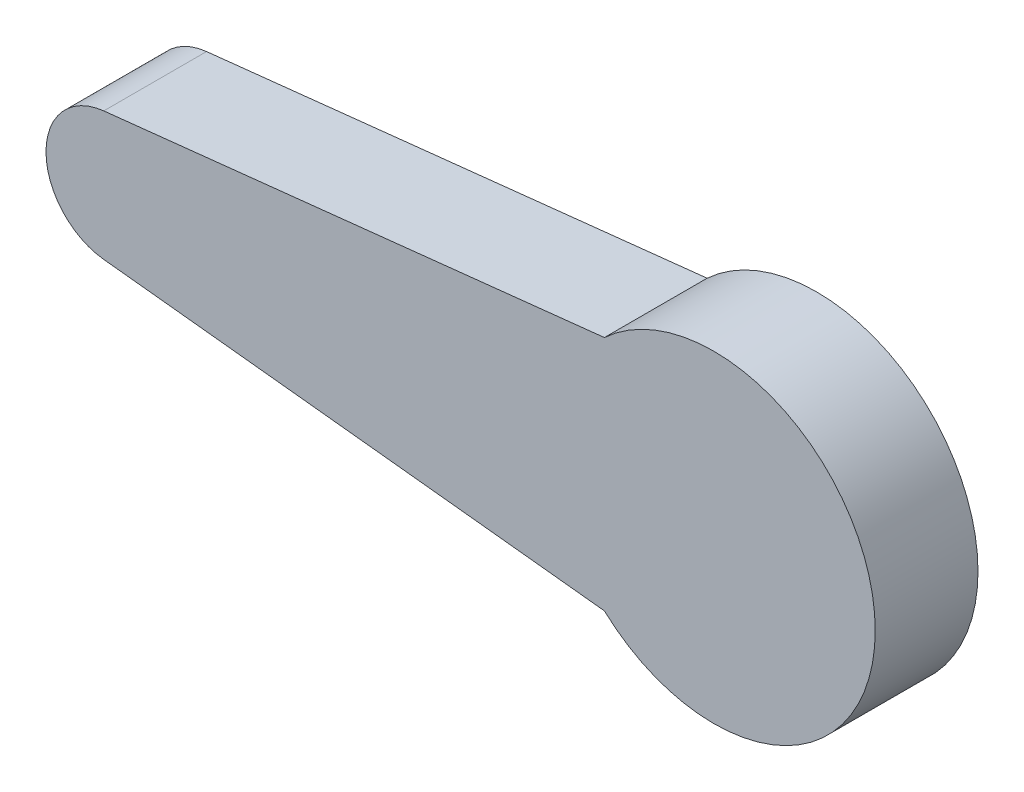
ISO-10303-21;
HEADER;
FILE_DESCRIPTION(('STEP AP214'),'2;1');
FILE_NAME('part.step','',(''),(''),'','','');
FILE_SCHEMA(('AUTOMOTIVE_DESIGN { 1 0 10303 214 1 1 1 1 }'));
ENDSEC;
DATA;
#1=APPLICATION_CONTEXT('core data for automotive mechanical design processes');
#2=APPLICATION_PROTOCOL_DEFINITION('international standard','automotive_design',2000,#1);
#3=PRODUCT_CONTEXT('',#1,'mechanical');
#4=PRODUCT('Part','Part','',(#3));
#5=PRODUCT_RELATED_PRODUCT_CATEGORY('part','',(#4));
#6=PRODUCT_DEFINITION_FORMATION('','',#4);
#7=PRODUCT_DEFINITION_CONTEXT('part definition',#1,'design');
#8=PRODUCT_DEFINITION('design','',#6,#7);
#9=PRODUCT_DEFINITION_SHAPE('','',#8);
#10=(LENGTH_UNIT() NAMED_UNIT(*) SI_UNIT(.MILLI.,.METRE.));
#11=(NAMED_UNIT(*) PLANE_ANGLE_UNIT() SI_UNIT($,.RADIAN.));
#12=(NAMED_UNIT(*) SI_UNIT($,.STERADIAN.) SOLID_ANGLE_UNIT());
#13=UNCERTAINTY_MEASURE_WITH_UNIT(LENGTH_MEASURE(1.E-05),#10,'distance_accuracy_value','');
#14=(GEOMETRIC_REPRESENTATION_CONTEXT(3) GLOBAL_UNCERTAINTY_ASSIGNED_CONTEXT((#13)) GLOBAL_UNIT_ASSIGNED_CONTEXT((#10,
#11,#12)) REPRESENTATION_CONTEXT('',''));
#15=CARTESIAN_POINT('',(0.,0.,0.));
#16=DIRECTION('',(0.,0.,1.));
#17=DIRECTION('',(1.,0.,0.));
#18=AXIS2_PLACEMENT_3D('',#15,#16,#17);
#19=CARTESIAN_POINT('',(-11.2799246231682,0.,0.));
#20=DIRECTION('',(0.,0.,1.));
#21=DIRECTION('',(1.,0.,0.));
#22=AXIS2_PLACEMENT_3D('',#19,#20,#21);
#23=PLANE('',#22);
#24=DIRECTION('',(-0.994225438983225,-0.10731158594771,0.));
#25=VECTOR('',#24,1.);
#26=CARTESIAN_POINT('',(7.93694518506527,4.60750982165337,0.));
#27=LINE('',#26,#25);
#28=CARTESIAN_POINT('',(7.93694518506527,4.60750982165337,0.));
#29=VERTEX_POINT('',#28);
#30=CARTESIAN_POINT('',(-11.5502114628193,2.50416625036577,0.));
#31=VERTEX_POINT('',#30);
#32=EDGE_CURVE('E134',#29,#31,#27,.T.);
#33=ORIENTED_EDGE('',*,*,#32,.F.);
#34=CARTESIAN_POINT('',(12.2013646778512,0.,0.));
#35=DIRECTION('',(0.,0.,-1.));
#36=DIRECTION('',(-1.,0.,0.));
#37=AXIS2_PLACEMENT_3D('',#34,#35,#36);
#38=CIRCLE('',#37,6.2780905032569);
#39=CARTESIAN_POINT('',(7.93694518506527,-4.60750982165337,0.));
#40=VERTEX_POINT('',#39);
#41=EDGE_CURVE('E145',#29,#40,#38,.T.);
#42=ORIENTED_EDGE('',*,*,#41,.T.);
#43=DIRECTION('',(0.994225438983225,-0.10731158594771,0.));
#44=VECTOR('',#43,1.);
#45=CARTESIAN_POINT('',(-11.5502114628193,-2.50416625036577,0.));
#46=LINE('',#45,#44);
#47=CARTESIAN_POINT('',(-11.5502114628193,-2.50416625036577,0.));
#48=VERTEX_POINT('',#47);
#49=EDGE_CURVE('E152',#48,#40,#46,.T.);
#50=ORIENTED_EDGE('',*,*,#49,.F.);
#51=CARTESIAN_POINT('',(-11.2799246231682,0.,0.));
#52=DIRECTION('',(0.,0.,1.));
#53=DIRECTION('',(1.,0.,0.));
#54=AXIS2_PLACEMENT_3D('',#51,#52,#53);
#55=CIRCLE('',#54,2.51871069898064);
#56=EDGE_CURVE('E137',#31,#48,#55,.T.);
#57=ORIENTED_EDGE('',*,*,#56,.F.);
#58=EDGE_LOOP('',(#33,#42,#50,#57));
#59=FACE_BOUND('',#58,.T.);
#60=CARTESIAN_POINT('',(-2.30825995095074,2.49806605279446,0.));
#61=CARTESIAN_POINT('',(-2.73027096534099,2.49868152297986,0.));
#62=CARTESIAN_POINT('',(-3.36525519111259,2.31776714159565,0.));
#63=CARTESIAN_POINT('',(-4.0519471173828,1.79121945249872,0.));
#64=CARTESIAN_POINT('',(-4.45450445000801,1.26652861552728,0.));
#65=CARTESIAN_POINT('',(-4.70755649296628,0.655614107295277,0.));
#66=CARTESIAN_POINT('',(-4.79387213088173,0.,0.));
#67=CARTESIAN_POINT('',(-4.70755649296628,-0.655614107295276,0.));
#68=CARTESIAN_POINT('',(-4.45450445000801,-1.26652861552729,0.));
#69=CARTESIAN_POINT('',(-4.0519471173828,-1.79121945249872,0.));
#70=CARTESIAN_POINT('',(-3.36525519111259,-2.31776714159565,0.));
#71=CARTESIAN_POINT('',(-2.73027096534099,-2.49868152297986,0.));
#72=CARTESIAN_POINT('',(-2.30825995095074,-2.49806605279446,0.));
#73=B_SPLINE_CURVE_WITH_KNOTS('',3,(#60,#61,#62,#63,#64,#65,#66,#67,#68,#69,#70,#71,#72),
.UNSPECIFIED.,.F.,.F.,(4,1,1,1,1,1,1,1,1,1,4),(0.,0.162547315698738,0.246910500112196,
0.331273484688599,0.415637005846892,0.5,0.584362994153108,0.668726515311401,0.753089499887804,
0.837452684301262,1.),.UNSPECIFIED.);
#74=CARTESIAN_POINT('',(-2.30825995095074,2.49806605279446,0.));
#75=VERTEX_POINT('',#74);
#76=CARTESIAN_POINT('',(-2.30825995095074,-2.49806605279446,0.));
#77=VERTEX_POINT('',#76);
#78=EDGE_CURVE('E56',#75,#77,#73,.T.);
#79=ORIENTED_EDGE('',*,*,#78,.T.);
#80=DIRECTION('',(0.998250566900798,-0.0591253387494285,0.));
#81=VECTOR('',#80,1.);
#82=CARTESIAN_POINT('',(9.37504414469004,-3.19005595520139,0.));
#83=LINE('',#82,#81);
#84=CARTESIAN_POINT('',(9.37504414469004,-3.19005595520139,0.));
#85=VERTEX_POINT('',#84);
#86=EDGE_CURVE('E133',#77,#85,#83,.T.);
#87=ORIENTED_EDGE('',*,*,#86,.T.);
#88=CARTESIAN_POINT('',(9.37504414469004,-3.19005595520139,0.));
#89=CARTESIAN_POINT('',(9.74360040876109,-3.53484293919703,0.));
#90=CARTESIAN_POINT('',(10.5428570191187,-3.88633535555283,0.));
#91=CARTESIAN_POINT('',(11.7382013204245,-4.05165126945385,0.));
#92=CARTESIAN_POINT('',(12.7877855246039,-3.91194774983133,0.));
#93=CARTESIAN_POINT('',(13.7642990955492,-3.50777948619926,0.));
#94=CARTESIAN_POINT('',(14.6032502640424,-2.86396771618949,0.));
#95=CARTESIAN_POINT('',(15.2468503589831,-2.02521728614815,0.));
#96=CARTESIAN_POINT('',(15.6516651084562,-1.04811231295659,0.));
#97=CARTESIAN_POINT('',(15.7889928154445,-0.000691817754812136,0.));
#98=CARTESIAN_POINT('',(15.6535287568039,1.05087958765089,0.));
#99=CARTESIAN_POINT('',(15.2393957517555,2.01553180953456,0.));
#100=CARTESIAN_POINT('',(14.749448402042,2.72799658708562,0.));
#101=CARTESIAN_POINT('',(14.1725249859326,3.12361030474993,0.));
#102=CARTESIAN_POINT('',(13.6476475877295,3.58835164958077,0.));
#103=CARTESIAN_POINT('',(12.7816062725977,3.90400354803467,0.));
#104=CARTESIAN_POINT('',(11.739855888239,4.05377842345117,0.));
#105=CARTESIAN_POINT('',(10.54211336446,3.88537929441961,0.));
#106=CARTESIAN_POINT('',(9.74376271711854,3.53505160690367,0.));
#107=CARTESIAN_POINT('',(9.37504414469004,3.19005595520139,0.));
#108=B_SPLINE_CURVE_WITH_KNOTS('',3,(#88,#89,#90,#91,#92,#93,#94,#95,#96,#97,#98,#99,#100,#101,
#102,#103,#104,#105,#106,#107),.UNSPECIFIED.,.F.,.F.,(4,1,1,1,1,1,1,1,1,1,1,1,1,1,1,1,1,4),(0.,
0.0851368769983083,0.144403022869954,0.2036691687416,0.262935433986645,0.32220149870547,
0.381467600441595,0.440733878928586,0.499999999999802,0.559266121071018,0.618532399558009,
0.677798501294134,0.702497282971547,0.737064566013355,0.7963308312584,0.855596977130046,
0.914863123001692,1.),.UNSPECIFIED.);
#109=CARTESIAN_POINT('',(9.37504414469004,3.19005595520139,0.));
#110=VERTEX_POINT('',#109);
#111=EDGE_CURVE('E305',#85,#110,#108,.T.);
#112=ORIENTED_EDGE('',*,*,#111,.T.);
#113=DIRECTION('',(-0.998250566900798,-0.0591253387494285,0.));
#114=VECTOR('',#113,1.);
#115=CARTESIAN_POINT('',(-2.30825995095074,2.49806605279446,0.));
#116=LINE('',#115,#114);
#117=EDGE_CURVE('E129',#110,#75,#116,.T.);
#118=ORIENTED_EDGE('',*,*,#117,.T.);
#119=EDGE_LOOP('',(#79,#87,#112,#118));
#120=FACE_BOUND('',#119,.T.);
#121=ADVANCED_FACE('F41',(#59,#120),#23,.F.);
#122=CARTESIAN_POINT('',(7.93694518506527,4.60750982165337,4.));
#123=DIRECTION('',(0.10731158594771,-0.994225438983225,0.));
#124=DIRECTION('',(0.994225438983225,0.10731158594771,0.));
#125=AXIS2_PLACEMENT_3D('',#122,#123,#124);
#126=PLANE('',#125);
#127=ORIENTED_EDGE('',*,*,#32,.T.);
#128=DIRECTION('',(0.,0.,-1.));
#129=VECTOR('',#128,1.);
#130=CARTESIAN_POINT('',(-11.5502114628193,2.50416625036577,4.));
#131=LINE('',#130,#129);
#132=CARTESIAN_POINT('',(-11.5502114628193,2.50416625036577,4.));
#133=VERTEX_POINT('',#132);
#134=EDGE_CURVE('E11',#133,#31,#131,.T.);
#135=ORIENTED_EDGE('',*,*,#134,.F.);
#136=DIRECTION('',(-0.994225438983225,-0.10731158594771,0.));
#137=VECTOR('',#136,1.);
#138=CARTESIAN_POINT('',(7.93694518506527,4.60750982165337,4.));
#139=LINE('',#138,#137);
#140=CARTESIAN_POINT('',(7.93694518506527,4.60750982165337,4.));
#141=VERTEX_POINT('',#140);
#142=EDGE_CURVE('E143',#141,#133,#139,.T.);
#143=ORIENTED_EDGE('',*,*,#142,.F.);
#144=DIRECTION('',(0.,0.,-1.));
#145=VECTOR('',#144,1.);
#146=CARTESIAN_POINT('',(7.93694518506527,4.60750982165337,4.));
#147=LINE('',#146,#145);
#148=EDGE_CURVE('E65',#141,#29,#147,.T.);
#149=ORIENTED_EDGE('',*,*,#148,.T.);
#150=EDGE_LOOP('',(#127,#135,#143,#149));
#151=FACE_BOUND('',#150,.T.);
#152=ADVANCED_FACE('F43',(#151),#126,.F.);
#153=CARTESIAN_POINT('',(-11.2799246231682,0.,4.));
#154=DIRECTION('',(0.,0.,-1.));
#155=DIRECTION('',(-1.,0.,0.));
#156=AXIS2_PLACEMENT_3D('',#153,#154,#155);
#157=CYLINDRICAL_SURFACE('',#156,2.51871069898064);
#158=ORIENTED_EDGE('',*,*,#56,.T.);
#159=DIRECTION('',(0.,0.,-1.));
#160=VECTOR('',#159,1.);
#161=CARTESIAN_POINT('',(-11.5502114628193,-2.50416625036577,4.));
#162=LINE('',#161,#160);
#163=CARTESIAN_POINT('',(-11.5502114628193,-2.50416625036577,4.));
#164=VERTEX_POINT('',#163);
#165=EDGE_CURVE('E49',#164,#48,#162,.T.);
#166=ORIENTED_EDGE('',*,*,#165,.F.);
#167=CARTESIAN_POINT('',(-11.2799246231682,0.,4.));
#168=DIRECTION('',(0.,0.,1.));
#169=DIRECTION('',(1.,0.,0.));
#170=AXIS2_PLACEMENT_3D('',#167,#168,#169);
#171=CIRCLE('',#170,2.51871069898064);
#172=EDGE_CURVE('E91',#133,#164,#171,.T.);
#173=ORIENTED_EDGE('',*,*,#172,.F.);
#174=ORIENTED_EDGE('',*,*,#134,.T.);
#175=EDGE_LOOP('',(#158,#166,#173,#174));
#176=FACE_BOUND('',#175,.T.);
#177=ADVANCED_FACE('F172',(#176),#157,.T.);
#178=CARTESIAN_POINT('',(-11.5502114628193,-2.50416625036577,4.));
#179=DIRECTION('',(0.10731158594771,0.994225438983225,0.));
#180=DIRECTION('',(-0.994225438983225,0.10731158594771,0.));
#181=AXIS2_PLACEMENT_3D('',#178,#179,#180);
#182=PLANE('',#181);
#183=ORIENTED_EDGE('',*,*,#49,.T.);
#184=DIRECTION('',(0.,0.,-1.));
#185=VECTOR('',#184,1.);
#186=CARTESIAN_POINT('',(7.93694518506527,-4.60750982165337,4.));
#187=LINE('',#186,#185);
#188=CARTESIAN_POINT('',(7.93694518506527,-4.60750982165337,4.));
#189=VERTEX_POINT('',#188);
#190=EDGE_CURVE('E158',#189,#40,#187,.T.);
#191=ORIENTED_EDGE('',*,*,#190,.F.);
#192=DIRECTION('',(0.994225438983225,-0.10731158594771,0.));
#193=VECTOR('',#192,1.);
#194=CARTESIAN_POINT('',(-11.5502114628193,-2.50416625036577,4.));
#195=LINE('',#194,#193);
#196=EDGE_CURVE('E147',#164,#189,#195,.T.);
#197=ORIENTED_EDGE('',*,*,#196,.F.);
#198=ORIENTED_EDGE('',*,*,#165,.T.);
#199=EDGE_LOOP('',(#183,#191,#197,#198));
#200=FACE_BOUND('',#199,.T.);
#201=ADVANCED_FACE('F163',(#200),#182,.F.);
#202=CARTESIAN_POINT('',(12.2013646778512,0.,4.));
#203=DIRECTION('',(0.,0.,-1.));
#204=DIRECTION('',(-1.,0.,0.));
#205=AXIS2_PLACEMENT_3D('',#202,#203,#204);
#206=CYLINDRICAL_SURFACE('',#205,6.2780905032569);
#207=ORIENTED_EDGE('',*,*,#41,.F.);
#208=ORIENTED_EDGE('',*,*,#148,.F.);
#209=CARTESIAN_POINT('',(12.2013646778512,0.,4.));
#210=DIRECTION('',(0.,0.,-1.));
#211=DIRECTION('',(-1.,0.,0.));
#212=AXIS2_PLACEMENT_3D('',#209,#210,#211);
#213=CIRCLE('',#212,6.2780905032569);
#214=EDGE_CURVE('E149',#141,#189,#213,.T.);
#215=ORIENTED_EDGE('',*,*,#214,.T.);
#216=ORIENTED_EDGE('',*,*,#190,.T.);
#217=EDGE_LOOP('',(#207,#208,#215,#216));
#218=FACE_BOUND('',#217,.T.);
#219=ADVANCED_FACE('F167',(#218),#206,.T.);
#220=CARTESIAN_POINT('',(-11.2799246231682,0.,4.));
#221=DIRECTION('',(0.,0.,1.));
#222=DIRECTION('',(1.,0.,0.));
#223=AXIS2_PLACEMENT_3D('',#220,#221,#222);
#224=PLANE('',#223);
#225=ORIENTED_EDGE('',*,*,#142,.T.);
#226=ORIENTED_EDGE('',*,*,#172,.T.);
#227=ORIENTED_EDGE('',*,*,#196,.T.);
#228=ORIENTED_EDGE('',*,*,#214,.F.);
#229=EDGE_LOOP('',(#225,#226,#227,#228));
#230=FACE_BOUND('',#229,.T.);
#231=ADVANCED_FACE('F170',(#230),#224,.T.);
#232=CARTESIAN_POINT('',(-2.30825995095074,2.49806605279446,2.));
#233=CARTESIAN_POINT('',(-2.73027096534099,2.49868152297986,2.));
#234=CARTESIAN_POINT('',(-3.36525519111259,2.31776714159565,2.));
#235=CARTESIAN_POINT('',(-4.0519471173828,1.79121945249872,2.));
#236=CARTESIAN_POINT('',(-4.45450445000801,1.26652861552728,2.));
#237=CARTESIAN_POINT('',(-4.70755649296628,0.655614107295277,2.));
#238=CARTESIAN_POINT('',(-4.79387213088173,0.,2.));
#239=CARTESIAN_POINT('',(-4.70755649296628,-0.655614107295276,2.));
#240=CARTESIAN_POINT('',(-4.45450445000801,-1.26652861552729,2.));
#241=CARTESIAN_POINT('',(-4.0519471173828,-1.79121945249872,2.));
#242=CARTESIAN_POINT('',(-3.36525519111259,-2.31776714159565,2.));
#243=CARTESIAN_POINT('',(-2.73027096534099,-2.49868152297986,2.));
#244=CARTESIAN_POINT('',(-2.30825995095074,-2.49806605279446,2.));
#245=B_SPLINE_CURVE_WITH_KNOTS('',3,(#232,#233,#234,#235,#236,#237,#238,#239,#240,#241,#242,
#243,#244),.UNSPECIFIED.,.F.,.F.,(4,1,1,1,1,1,1,1,1,1,4),(0.,0.162547315698738,
0.246910500112196,0.331273484688599,0.415637005846892,0.5,0.584362994153108,0.668726515311401,
0.753089499887804,0.837452684301262,1.),.UNSPECIFIED.);
#246=DIRECTION('',(0.,0.,-1.));
#247=VECTOR('',#246,1.);
#248=SURFACE_OF_LINEAR_EXTRUSION('',#245,#247);
#249=ORIENTED_EDGE('',*,*,#78,.F.);
#250=DIRECTION('',(0.,0.,-1.));
#251=VECTOR('',#250,1.);
#252=CARTESIAN_POINT('',(-2.30825995095074,2.49806605279446,2.));
#253=LINE('',#252,#251);
#254=CARTESIAN_POINT('',(-2.30825995095074,2.49806605279446,2.));
#255=VERTEX_POINT('',#254);
#256=EDGE_CURVE('E128',#255,#75,#253,.T.);
#257=ORIENTED_EDGE('',*,*,#256,.F.);
#258=CARTESIAN_POINT('',(-2.30825995095074,-2.49806605279446,2.));
#259=VERTEX_POINT('',#258);
#260=EDGE_CURVE('E120',#255,#259,#245,.T.);
#261=ORIENTED_EDGE('',*,*,#260,.T.);
#262=DIRECTION('',(0.,0.,-1.));
#263=VECTOR('',#262,1.);
#264=CARTESIAN_POINT('',(-2.30825995095074,-2.49806605279446,2.));
#265=LINE('',#264,#263);
#266=EDGE_CURVE('E127',#259,#77,#265,.T.);
#267=ORIENTED_EDGE('',*,*,#266,.T.);
#268=EDGE_LOOP('',(#249,#257,#261,#267));
#269=FACE_BOUND('',#268,.T.);
#270=ADVANCED_FACE('F126',(#269),#248,.T.);
#271=CARTESIAN_POINT('',(9.37504414469004,-3.19005595520139,2.));
#272=DIRECTION('',(0.0591253387494286,0.998250566900798,0.));
#273=DIRECTION('',(-0.998250566900798,0.0591253387494286,0.));
#274=AXIS2_PLACEMENT_3D('',#271,#272,#273);
#275=PLANE('',#274);
#276=ORIENTED_EDGE('',*,*,#86,.F.);
#277=ORIENTED_EDGE('',*,*,#266,.F.);
#278=DIRECTION('',(0.998250566900798,-0.0591253387494285,0.));
#279=VECTOR('',#278,1.);
#280=CARTESIAN_POINT('',(9.37504414469004,-3.19005595520139,2.));
#281=LINE('',#280,#279);
#282=CARTESIAN_POINT('',(9.37504414469004,-3.19005595520139,2.));
#283=VERTEX_POINT('',#282);
#284=EDGE_CURVE('E116',#259,#283,#281,.T.);
#285=ORIENTED_EDGE('',*,*,#284,.T.);
#286=DIRECTION('',(0.,0.,-1.));
#287=VECTOR('',#286,1.);
#288=CARTESIAN_POINT('',(9.37504414469004,-3.19005595520139,2.));
#289=LINE('',#288,#287);
#290=EDGE_CURVE('E135',#283,#85,#289,.T.);
#291=ORIENTED_EDGE('',*,*,#290,.T.);
#292=EDGE_LOOP('',(#276,#277,#285,#291));
#293=FACE_BOUND('',#292,.T.);
#294=ADVANCED_FACE('F131',(#293),#275,.T.);
#295=CARTESIAN_POINT('',(9.37504414469004,-3.19005595520139,2.));
#296=CARTESIAN_POINT('',(9.74360040876109,-3.53484293919703,2.));
#297=CARTESIAN_POINT('',(10.5428570191187,-3.88633535555283,2.));
#298=CARTESIAN_POINT('',(11.7382013204245,-4.05165126945385,2.));
#299=CARTESIAN_POINT('',(12.7877855246039,-3.91194774983133,2.));
#300=CARTESIAN_POINT('',(13.7642990955492,-3.50777948619926,2.));
#301=CARTESIAN_POINT('',(14.6032502640424,-2.86396771618949,2.));
#302=CARTESIAN_POINT('',(15.2468503589831,-2.02521728614815,2.));
#303=CARTESIAN_POINT('',(15.6516651084562,-1.04811231295659,2.));
#304=CARTESIAN_POINT('',(15.7889928154445,-0.000691817754812136,2.));
#305=CARTESIAN_POINT('',(15.6535287568039,1.05087958765089,2.));
#306=CARTESIAN_POINT('',(15.2393957517555,2.01553180953456,2.));
#307=CARTESIAN_POINT('',(14.749448402042,2.72799658708562,2.));
#308=CARTESIAN_POINT('',(14.1725249859326,3.12361030474993,2.));
#309=CARTESIAN_POINT('',(13.6476475877295,3.58835164958077,2.));
#310=CARTESIAN_POINT('',(12.7816062725977,3.90400354803467,2.));
#311=CARTESIAN_POINT('',(11.739855888239,4.05377842345117,2.));
#312=CARTESIAN_POINT('',(10.54211336446,3.88537929441961,2.));
#313=CARTESIAN_POINT('',(9.74376271711854,3.53505160690367,2.));
#314=CARTESIAN_POINT('',(9.37504414469004,3.19005595520139,2.));
#315=B_SPLINE_CURVE_WITH_KNOTS('',3,(#295,#296,#297,#298,#299,#300,#301,#302,#303,#304,#305,
#306,#307,#308,#309,#310,#311,#312,#313,#314),.UNSPECIFIED.,.F.,.F.,(4,1,1,1,1,1,1,1,1,1,1,1,1,
1,1,1,1,4),(0.,0.0851368769983083,0.144403022869954,0.2036691687416,0.262935433986645,
0.32220149870547,0.381467600441595,0.440733878928586,0.499999999999802,0.559266121071018,
0.618532399558009,0.677798501294134,0.702497282971547,0.737064566013355,0.7963308312584,
0.855596977130046,0.914863123001692,1.),.UNSPECIFIED.);
#316=DIRECTION('',(0.,0.,-1.));
#317=VECTOR('',#316,1.);
#318=SURFACE_OF_LINEAR_EXTRUSION('',#315,#317);
#319=ORIENTED_EDGE('',*,*,#111,.F.);
#320=ORIENTED_EDGE('',*,*,#290,.F.);
#321=CARTESIAN_POINT('',(9.37504414469004,3.19005595520139,2.));
#322=VERTEX_POINT('',#321);
#323=EDGE_CURVE('E121',#283,#322,#315,.T.);
#324=ORIENTED_EDGE('',*,*,#323,.T.);
#325=DIRECTION('',(0.,0.,-1.));
#326=VECTOR('',#325,1.);
#327=CARTESIAN_POINT('',(9.37504414469004,3.19005595520139,2.));
#328=LINE('',#327,#326);
#329=EDGE_CURVE('E139',#322,#110,#328,.T.);
#330=ORIENTED_EDGE('',*,*,#329,.T.);
#331=EDGE_LOOP('',(#319,#320,#324,#330));
#332=FACE_BOUND('',#331,.T.);
#333=ADVANCED_FACE('F196',(#332),#318,.T.);
#334=CARTESIAN_POINT('',(-2.30825995095074,2.49806605279446,2.));
#335=DIRECTION('',(0.0591253387494286,-0.998250566900798,0.));
#336=DIRECTION('',(0.998250566900798,0.0591253387494286,0.));
#337=AXIS2_PLACEMENT_3D('',#334,#335,#336);
#338=PLANE('',#337);
#339=ORIENTED_EDGE('',*,*,#117,.F.);
#340=ORIENTED_EDGE('',*,*,#329,.F.);
#341=DIRECTION('',(-0.998250566900798,-0.0591253387494285,0.));
#342=VECTOR('',#341,1.);
#343=CARTESIAN_POINT('',(-2.30825995095074,2.49806605279446,2.));
#344=LINE('',#343,#342);
#345=EDGE_CURVE('E210',#322,#255,#344,.T.);
#346=ORIENTED_EDGE('',*,*,#345,.T.);
#347=ORIENTED_EDGE('',*,*,#256,.T.);
#348=EDGE_LOOP('',(#339,#340,#346,#347));
#349=FACE_BOUND('',#348,.T.);
#350=ADVANCED_FACE('F217',(#349),#338,.T.);
#351=CARTESIAN_POINT('',(-4.76510031148791,0.,2.));
#352=DIRECTION('',(0.,0.,1.));
#353=DIRECTION('',(1.,0.,0.));
#354=AXIS2_PLACEMENT_3D('',#351,#352,#353);
#355=PLANE('',#354);
#356=ORIENTED_EDGE('',*,*,#260,.F.);
#357=ORIENTED_EDGE('',*,*,#345,.F.);
#358=ORIENTED_EDGE('',*,*,#323,.F.);
#359=ORIENTED_EDGE('',*,*,#284,.F.);
#360=EDGE_LOOP('',(#356,#357,#358,#359));
#361=FACE_BOUND('',#360,.T.);
#362=ADVANCED_FACE('F118',(#361),#355,.F.);
#363=CLOSED_SHELL('',(#121,#152,#177,#201,#219,#231,#270,#294,#333,#350,#362));
#364=MANIFOLD_SOLID_BREP('B2',#363);
#365=ADVANCED_BREP_SHAPE_REPRESENTATION('',(#18,#364),#14);
#366=SHAPE_DEFINITION_REPRESENTATION(#9,#365);
ENDSEC;
END-ISO-10303-21;
